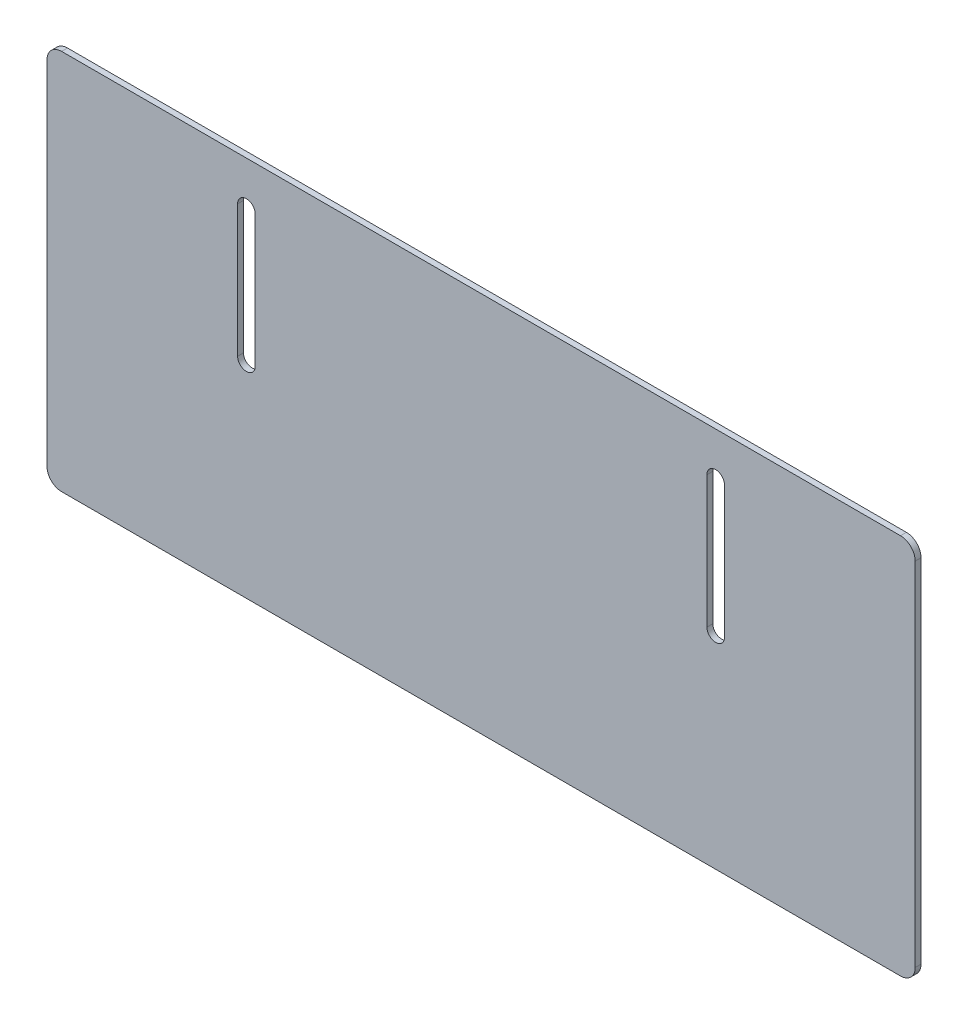
ISO-10303-21;
HEADER;
FILE_DESCRIPTION(('STEP AP214'),'2;1');
FILE_NAME('part.step','',(''),(''),'','','');
FILE_SCHEMA(('AUTOMOTIVE_DESIGN { 1 0 10303 214 1 1 1 1 }'));
ENDSEC;
DATA;
#1=APPLICATION_CONTEXT('core data for automotive mechanical design processes');
#2=APPLICATION_PROTOCOL_DEFINITION('international standard','automotive_design',2000,#1);
#3=PRODUCT_CONTEXT('',#1,'mechanical');
#4=PRODUCT('Part','Part','',(#3));
#5=PRODUCT_RELATED_PRODUCT_CATEGORY('part','',(#4));
#6=PRODUCT_DEFINITION_FORMATION('','',#4);
#7=PRODUCT_DEFINITION_CONTEXT('part definition',#1,'design');
#8=PRODUCT_DEFINITION('design','',#6,#7);
#9=PRODUCT_DEFINITION_SHAPE('','',#8);
#10=(LENGTH_UNIT() NAMED_UNIT(*) SI_UNIT(.MILLI.,.METRE.));
#11=(NAMED_UNIT(*) PLANE_ANGLE_UNIT() SI_UNIT($,.RADIAN.));
#12=(NAMED_UNIT(*) SI_UNIT($,.STERADIAN.) SOLID_ANGLE_UNIT());
#13=UNCERTAINTY_MEASURE_WITH_UNIT(LENGTH_MEASURE(1.E-05),#10,'distance_accuracy_value','');
#14=(GEOMETRIC_REPRESENTATION_CONTEXT(3) GLOBAL_UNCERTAINTY_ASSIGNED_CONTEXT((#13)) GLOBAL_UNIT_ASSIGNED_CONTEXT((#10,
#11,#12)) REPRESENTATION_CONTEXT('',''));
#15=CARTESIAN_POINT('',(0.,0.,0.));
#16=DIRECTION('',(0.,0.,1.));
#17=DIRECTION('',(1.,0.,0.));
#18=AXIS2_PLACEMENT_3D('',#15,#16,#17);
#19=CARTESIAN_POINT('',(-148.,65.,0.));
#20=DIRECTION('',(0.,-1.,0.));
#21=DIRECTION('',(-1.,0.,0.));
#22=AXIS2_PLACEMENT_3D('',#19,#20,#21);
#23=PLANE('',#22);
#24=DIRECTION('',(0.,0.,1.));
#25=VECTOR('',#24,1.);
#26=CARTESIAN_POINT('',(143.,65.,0.));
#27=LINE('',#26,#25);
#28=CARTESIAN_POINT('',(143.,65.,-2.));
#29=VERTEX_POINT('',#28);
#30=CARTESIAN_POINT('',(143.,65.,0.));
#31=VERTEX_POINT('',#30);
#32=EDGE_CURVE('E11',#29,#31,#27,.T.);
#33=ORIENTED_EDGE('',*,*,#32,.F.);
#34=DIRECTION('',(-1.,0.,0.));
#35=VECTOR('',#34,1.);
#36=CARTESIAN_POINT('',(0.,65.,-2.));
#37=LINE('',#36,#35);
#38=CARTESIAN_POINT('',(-143.,65.,-2.));
#39=VERTEX_POINT('',#38);
#40=EDGE_CURVE('E129',#29,#39,#37,.T.);
#41=ORIENTED_EDGE('',*,*,#40,.T.);
#42=DIRECTION('',(0.,0.,1.));
#43=VECTOR('',#42,1.);
#44=CARTESIAN_POINT('',(-143.,65.,0.));
#45=LINE('',#44,#43);
#46=CARTESIAN_POINT('',(-143.,65.,0.));
#47=VERTEX_POINT('',#46);
#48=EDGE_CURVE('E47',#39,#47,#45,.T.);
#49=ORIENTED_EDGE('',*,*,#48,.T.);
#50=DIRECTION('',(-1.,0.,0.));
#51=VECTOR('',#50,1.);
#52=CARTESIAN_POINT('',(-148.,65.,0.));
#53=LINE('',#52,#51);
#54=EDGE_CURVE('E197',#31,#47,#53,.T.);
#55=ORIENTED_EDGE('',*,*,#54,.F.);
#56=EDGE_LOOP('',(#33,#41,#49,#55));
#57=FACE_BOUND('',#56,.T.);
#58=ADVANCED_FACE('F37',(#57),#23,.F.);
#59=CARTESIAN_POINT('',(-143.,60.,0.));
#60=DIRECTION('',(0.,0.,-1.));
#61=DIRECTION('',(-1.,0.,0.));
#62=AXIS2_PLACEMENT_3D('',#59,#60,#61);
#63=CYLINDRICAL_SURFACE('',#62,5.);
#64=ORIENTED_EDGE('',*,*,#48,.F.);
#65=CARTESIAN_POINT('',(-143.,60.,-2.));
#66=DIRECTION('',(0.,0.,-1.));
#67=DIRECTION('',(-1.,0.,0.));
#68=AXIS2_PLACEMENT_3D('',#65,#66,#67);
#69=CIRCLE('',#68,5.);
#70=CARTESIAN_POINT('',(-148.,60.,-2.));
#71=VERTEX_POINT('',#70);
#72=EDGE_CURVE('E153',#39,#71,#69,.F.);
#73=ORIENTED_EDGE('',*,*,#72,.T.);
#74=DIRECTION('',(0.,0.,1.));
#75=VECTOR('',#74,1.);
#76=CARTESIAN_POINT('',(-148.,60.,0.));
#77=LINE('',#76,#75);
#78=CARTESIAN_POINT('',(-148.,60.,0.));
#79=VERTEX_POINT('',#78);
#80=EDGE_CURVE('E190',#71,#79,#77,.T.);
#81=ORIENTED_EDGE('',*,*,#80,.T.);
#82=CARTESIAN_POINT('',(-143.,60.,0.));
#83=DIRECTION('',(0.,0.,-1.));
#84=DIRECTION('',(-1.,0.,0.));
#85=AXIS2_PLACEMENT_3D('',#82,#83,#84);
#86=CIRCLE('',#85,5.);
#87=EDGE_CURVE('E206',#47,#79,#86,.F.);
#88=ORIENTED_EDGE('',*,*,#87,.F.);
#89=EDGE_LOOP('',(#64,#73,#81,#88));
#90=FACE_BOUND('',#89,.T.);
#91=ADVANCED_FACE('F209',(#90),#63,.T.);
#92=CARTESIAN_POINT('',(-148.,-65.,0.));
#93=DIRECTION('',(1.,0.,0.));
#94=DIRECTION('',(0.,-1.,0.));
#95=AXIS2_PLACEMENT_3D('',#92,#93,#94);
#96=PLANE('',#95);
#97=ORIENTED_EDGE('',*,*,#80,.F.);
#98=DIRECTION('',(0.,1.,0.));
#99=VECTOR('',#98,1.);
#100=CARTESIAN_POINT('',(-148.,0.,-2.));
#101=LINE('',#100,#99);
#102=CARTESIAN_POINT('',(-148.,-60.,-2.));
#103=VERTEX_POINT('',#102);
#104=EDGE_CURVE('E150',#71,#103,#101,.F.);
#105=ORIENTED_EDGE('',*,*,#104,.T.);
#106=DIRECTION('',(0.,0.,1.));
#107=VECTOR('',#106,1.);
#108=CARTESIAN_POINT('',(-148.,-60.,0.));
#109=LINE('',#108,#107);
#110=CARTESIAN_POINT('',(-148.,-60.,0.));
#111=VERTEX_POINT('',#110);
#112=EDGE_CURVE('E187',#103,#111,#109,.T.);
#113=ORIENTED_EDGE('',*,*,#112,.T.);
#114=DIRECTION('',(0.,-1.,0.));
#115=VECTOR('',#114,1.);
#116=CARTESIAN_POINT('',(-148.,-65.,0.));
#117=LINE('',#116,#115);
#118=EDGE_CURVE('E210',#79,#111,#117,.T.);
#119=ORIENTED_EDGE('',*,*,#118,.F.);
#120=EDGE_LOOP('',(#97,#105,#113,#119));
#121=FACE_BOUND('',#120,.T.);
#122=ADVANCED_FACE('F337',(#121),#96,.F.);
#123=CARTESIAN_POINT('',(-143.,-60.,0.));
#124=DIRECTION('',(0.,0.,-1.));
#125=DIRECTION('',(-1.,0.,0.));
#126=AXIS2_PLACEMENT_3D('',#123,#124,#125);
#127=CYLINDRICAL_SURFACE('',#126,5.);
#128=ORIENTED_EDGE('',*,*,#112,.F.);
#129=CARTESIAN_POINT('',(-143.,-60.,-2.));
#130=DIRECTION('',(0.,0.,-1.));
#131=DIRECTION('',(-1.,0.,0.));
#132=AXIS2_PLACEMENT_3D('',#129,#130,#131);
#133=CIRCLE('',#132,5.);
#134=CARTESIAN_POINT('',(-143.,-65.,-2.));
#135=VERTEX_POINT('',#134);
#136=EDGE_CURVE('E147',#103,#135,#133,.F.);
#137=ORIENTED_EDGE('',*,*,#136,.T.);
#138=DIRECTION('',(0.,0.,1.));
#139=VECTOR('',#138,1.);
#140=CARTESIAN_POINT('',(-143.,-65.,0.));
#141=LINE('',#140,#139);
#142=CARTESIAN_POINT('',(-143.,-65.,0.));
#143=VERTEX_POINT('',#142);
#144=EDGE_CURVE('E184',#135,#143,#141,.T.);
#145=ORIENTED_EDGE('',*,*,#144,.T.);
#146=CARTESIAN_POINT('',(-143.,-60.,0.));
#147=DIRECTION('',(0.,0.,-1.));
#148=DIRECTION('',(-1.,0.,0.));
#149=AXIS2_PLACEMENT_3D('',#146,#147,#148);
#150=CIRCLE('',#149,5.);
#151=EDGE_CURVE('E212',#111,#143,#150,.F.);
#152=ORIENTED_EDGE('',*,*,#151,.F.);
#153=EDGE_LOOP('',(#128,#137,#145,#152));
#154=FACE_BOUND('',#153,.T.);
#155=ADVANCED_FACE('F269',(#154),#127,.T.);
#156=CARTESIAN_POINT('',(-148.,-65.,0.));
#157=DIRECTION('',(0.,1.,0.));
#158=DIRECTION('',(1.,0.,0.));
#159=AXIS2_PLACEMENT_3D('',#156,#157,#158);
#160=PLANE('',#159);
#161=ORIENTED_EDGE('',*,*,#144,.F.);
#162=DIRECTION('',(-1.,0.,0.));
#163=VECTOR('',#162,1.);
#164=CARTESIAN_POINT('',(0.,-65.,-2.));
#165=LINE('',#164,#163);
#166=CARTESIAN_POINT('',(143.,-65.,-2.));
#167=VERTEX_POINT('',#166);
#168=EDGE_CURVE('E144',#135,#167,#165,.F.);
#169=ORIENTED_EDGE('',*,*,#168,.T.);
#170=DIRECTION('',(0.,0.,1.));
#171=VECTOR('',#170,1.);
#172=CARTESIAN_POINT('',(143.,-65.,0.));
#173=LINE('',#172,#171);
#174=CARTESIAN_POINT('',(143.,-65.,0.));
#175=VERTEX_POINT('',#174);
#176=EDGE_CURVE('E182',#167,#175,#173,.T.);
#177=ORIENTED_EDGE('',*,*,#176,.T.);
#178=DIRECTION('',(1.,0.,0.));
#179=VECTOR('',#178,1.);
#180=CARTESIAN_POINT('',(-148.,-65.,0.));
#181=LINE('',#180,#179);
#182=EDGE_CURVE('E218',#143,#175,#181,.T.);
#183=ORIENTED_EDGE('',*,*,#182,.F.);
#184=EDGE_LOOP('',(#161,#169,#177,#183));
#185=FACE_BOUND('',#184,.T.);
#186=ADVANCED_FACE('F274',(#185),#160,.F.);
#187=CARTESIAN_POINT('',(143.,-60.,0.));
#188=DIRECTION('',(0.,0.,-1.));
#189=DIRECTION('',(-1.,0.,0.));
#190=AXIS2_PLACEMENT_3D('',#187,#188,#189);
#191=CYLINDRICAL_SURFACE('',#190,5.);
#192=ORIENTED_EDGE('',*,*,#176,.F.);
#193=CARTESIAN_POINT('',(143.,-60.,-2.));
#194=DIRECTION('',(0.,0.,-1.));
#195=DIRECTION('',(-1.,0.,0.));
#196=AXIS2_PLACEMENT_3D('',#193,#194,#195);
#197=CIRCLE('',#196,5.);
#198=CARTESIAN_POINT('',(148.,-60.,-2.));
#199=VERTEX_POINT('',#198);
#200=EDGE_CURVE('E141',#167,#199,#197,.F.);
#201=ORIENTED_EDGE('',*,*,#200,.T.);
#202=DIRECTION('',(0.,0.,1.));
#203=VECTOR('',#202,1.);
#204=CARTESIAN_POINT('',(148.,-60.,0.));
#205=LINE('',#204,#203);
#206=CARTESIAN_POINT('',(148.,-60.,0.));
#207=VERTEX_POINT('',#206);
#208=EDGE_CURVE('E55',#199,#207,#205,.T.);
#209=ORIENTED_EDGE('',*,*,#208,.T.);
#210=CARTESIAN_POINT('',(143.,-60.,0.));
#211=DIRECTION('',(0.,0.,-1.));
#212=DIRECTION('',(-1.,0.,0.));
#213=AXIS2_PLACEMENT_3D('',#210,#211,#212);
#214=CIRCLE('',#213,5.);
#215=EDGE_CURVE('E170',#175,#207,#214,.F.);
#216=ORIENTED_EDGE('',*,*,#215,.F.);
#217=EDGE_LOOP('',(#192,#201,#209,#216));
#218=FACE_BOUND('',#217,.T.);
#219=ADVANCED_FACE('F275',(#218),#191,.T.);
#220=CARTESIAN_POINT('',(148.,-65.,0.));
#221=DIRECTION('',(-1.,0.,0.));
#222=DIRECTION('',(0.,1.,0.));
#223=AXIS2_PLACEMENT_3D('',#220,#221,#222);
#224=PLANE('',#223);
#225=ORIENTED_EDGE('',*,*,#208,.F.);
#226=DIRECTION('',(0.,1.,0.));
#227=VECTOR('',#226,1.);
#228=CARTESIAN_POINT('',(148.,0.,-2.));
#229=LINE('',#228,#227);
#230=CARTESIAN_POINT('',(148.,60.,-2.));
#231=VERTEX_POINT('',#230);
#232=EDGE_CURVE('E127',#199,#231,#229,.T.);
#233=ORIENTED_EDGE('',*,*,#232,.T.);
#234=DIRECTION('',(0.,0.,1.));
#235=VECTOR('',#234,1.);
#236=CARTESIAN_POINT('',(148.,60.,0.));
#237=LINE('',#236,#235);
#238=CARTESIAN_POINT('',(148.,60.,0.));
#239=VERTEX_POINT('',#238);
#240=EDGE_CURVE('E41',#231,#239,#237,.T.);
#241=ORIENTED_EDGE('',*,*,#240,.T.);
#242=DIRECTION('',(0.,1.,0.));
#243=VECTOR('',#242,1.);
#244=CARTESIAN_POINT('',(148.,-65.,0.));
#245=LINE('',#244,#243);
#246=EDGE_CURVE('E276',#207,#239,#245,.T.);
#247=ORIENTED_EDGE('',*,*,#246,.F.);
#248=EDGE_LOOP('',(#225,#233,#241,#247));
#249=FACE_BOUND('',#248,.T.);
#250=ADVANCED_FACE('F131',(#249),#224,.F.);
#251=CARTESIAN_POINT('',(77.,50.,0.));
#252=DIRECTION('',(1.,0.,0.));
#253=DIRECTION('',(0.,-1.,0.));
#254=AXIS2_PLACEMENT_3D('',#251,#252,#253);
#255=PLANE('',#254);
#256=DIRECTION('',(0.,0.,1.));
#257=VECTOR('',#256,1.);
#258=CARTESIAN_POINT('',(77.,5.00000000000002,0.));
#259=LINE('',#258,#257);
#260=CARTESIAN_POINT('',(77.,5.00000000000002,-2.));
#261=VERTEX_POINT('',#260);
#262=CARTESIAN_POINT('',(77.,5.00000000000002,0.));
#263=VERTEX_POINT('',#262);
#264=EDGE_CURVE('E122',#261,#263,#259,.T.);
#265=ORIENTED_EDGE('',*,*,#264,.F.);
#266=DIRECTION('',(0.,1.,0.));
#267=VECTOR('',#266,1.);
#268=CARTESIAN_POINT('',(77.,0.,-2.));
#269=LINE('',#268,#267);
#270=CARTESIAN_POINT('',(77.,50.,-2.));
#271=VERTEX_POINT('',#270);
#272=EDGE_CURVE('E135',#271,#261,#269,.F.);
#273=ORIENTED_EDGE('',*,*,#272,.F.);
#274=DIRECTION('',(0.,0.,1.));
#275=VECTOR('',#274,1.);
#276=CARTESIAN_POINT('',(77.,50.,0.));
#277=LINE('',#276,#275);
#278=CARTESIAN_POINT('',(77.,50.,0.));
#279=VERTEX_POINT('',#278);
#280=EDGE_CURVE('E174',#271,#279,#277,.T.);
#281=ORIENTED_EDGE('',*,*,#280,.T.);
#282=DIRECTION('',(0.,-1.,0.));
#283=VECTOR('',#282,1.);
#284=CARTESIAN_POINT('',(77.,50.,0.));
#285=LINE('',#284,#283);
#286=EDGE_CURVE('E278',#279,#263,#285,.T.);
#287=ORIENTED_EDGE('',*,*,#286,.T.);
#288=EDGE_LOOP('',(#265,#273,#281,#287));
#289=FACE_BOUND('',#288,.T.);
#290=ADVANCED_FACE('F323',(#289),#255,.T.);
#291=CARTESIAN_POINT('',(80.,50.,0.));
#292=DIRECTION('',(0.,0.,-1.));
#293=DIRECTION('',(-1.,0.,0.));
#294=AXIS2_PLACEMENT_3D('',#291,#292,#293);
#295=CYLINDRICAL_SURFACE('',#294,2.99999999999999);
#296=ORIENTED_EDGE('',*,*,#280,.F.);
#297=CARTESIAN_POINT('',(80.,50.,-2.));
#298=DIRECTION('',(0.,0.,1.));
#299=DIRECTION('',(1.,0.,0.));
#300=AXIS2_PLACEMENT_3D('',#297,#298,#299);
#301=CIRCLE('',#300,2.99999999999999);
#302=CARTESIAN_POINT('',(83.,50.,-2.));
#303=VERTEX_POINT('',#302);
#304=EDGE_CURVE('E132',#303,#271,#301,.T.);
#305=ORIENTED_EDGE('',*,*,#304,.F.);
#306=DIRECTION('',(0.,0.,1.));
#307=VECTOR('',#306,1.);
#308=CARTESIAN_POINT('',(83.,50.,0.));
#309=LINE('',#308,#307);
#310=CARTESIAN_POINT('',(83.,50.,0.));
#311=VERTEX_POINT('',#310);
#312=EDGE_CURVE('E171',#303,#311,#309,.T.);
#313=ORIENTED_EDGE('',*,*,#312,.T.);
#314=CARTESIAN_POINT('',(80.,50.,0.));
#315=DIRECTION('',(0.,0.,1.));
#316=DIRECTION('',(-1.,0.,0.));
#317=AXIS2_PLACEMENT_3D('',#314,#315,#316);
#318=CIRCLE('',#317,2.99999999999999);
#319=EDGE_CURVE('E257',#311,#279,#318,.T.);
#320=ORIENTED_EDGE('',*,*,#319,.T.);
#321=EDGE_LOOP('',(#296,#305,#313,#320));
#322=FACE_BOUND('',#321,.T.);
#323=ADVANCED_FACE('F255',(#322),#295,.F.);
#324=CARTESIAN_POINT('',(83.,50.,0.));
#325=DIRECTION('',(-1.,0.,0.));
#326=DIRECTION('',(0.,1.,0.));
#327=AXIS2_PLACEMENT_3D('',#324,#325,#326);
#328=PLANE('',#327);
#329=ORIENTED_EDGE('',*,*,#312,.F.);
#330=DIRECTION('',(0.,1.,0.));
#331=VECTOR('',#330,1.);
#332=CARTESIAN_POINT('',(83.,0.,-2.));
#333=LINE('',#332,#331);
#334=CARTESIAN_POINT('',(83.,5.00000000000002,-2.));
#335=VERTEX_POINT('',#334);
#336=EDGE_CURVE('E230',#335,#303,#333,.T.);
#337=ORIENTED_EDGE('',*,*,#336,.F.);
#338=DIRECTION('',(0.,0.,1.));
#339=VECTOR('',#338,1.);
#340=CARTESIAN_POINT('',(83.,5.00000000000002,0.));
#341=LINE('',#340,#339);
#342=CARTESIAN_POINT('',(83.,5.00000000000002,0.));
#343=VERTEX_POINT('',#342);
#344=EDGE_CURVE('E167',#335,#343,#341,.T.);
#345=ORIENTED_EDGE('',*,*,#344,.T.);
#346=DIRECTION('',(0.,1.,0.));
#347=VECTOR('',#346,1.);
#348=CARTESIAN_POINT('',(83.,50.,0.));
#349=LINE('',#348,#347);
#350=EDGE_CURVE('E251',#343,#311,#349,.T.);
#351=ORIENTED_EDGE('',*,*,#350,.T.);
#352=EDGE_LOOP('',(#329,#337,#345,#351));
#353=FACE_BOUND('',#352,.T.);
#354=ADVANCED_FACE('F246',(#353),#328,.T.);
#355=CARTESIAN_POINT('',(-77.,50.,0.));
#356=DIRECTION('',(-1.,0.,0.));
#357=DIRECTION('',(0.,1.,0.));
#358=AXIS2_PLACEMENT_3D('',#355,#356,#357);
#359=PLANE('',#358);
#360=DIRECTION('',(0.,0.,1.));
#361=VECTOR('',#360,1.);
#362=CARTESIAN_POINT('',(-77.,50.,0.));
#363=LINE('',#362,#361);
#364=CARTESIAN_POINT('',(-77.,50.,-2.));
#365=VERTEX_POINT('',#364);
#366=CARTESIAN_POINT('',(-77.,50.,0.));
#367=VERTEX_POINT('',#366);
#368=EDGE_CURVE('E164',#365,#367,#363,.T.);
#369=ORIENTED_EDGE('',*,*,#368,.F.);
#370=DIRECTION('',(0.,1.,0.));
#371=VECTOR('',#370,1.);
#372=CARTESIAN_POINT('',(-77.,0.,-2.));
#373=LINE('',#372,#371);
#374=CARTESIAN_POINT('',(-77.,5.00000000000001,-2.));
#375=VERTEX_POINT('',#374);
#376=EDGE_CURVE('E231',#375,#365,#373,.T.);
#377=ORIENTED_EDGE('',*,*,#376,.F.);
#378=DIRECTION('',(0.,0.,1.));
#379=VECTOR('',#378,1.);
#380=CARTESIAN_POINT('',(-77.,5.00000000000001,0.));
#381=LINE('',#380,#379);
#382=CARTESIAN_POINT('',(-77.,5.00000000000001,0.));
#383=VERTEX_POINT('',#382);
#384=EDGE_CURVE('E160',#375,#383,#381,.T.);
#385=ORIENTED_EDGE('',*,*,#384,.T.);
#386=DIRECTION('',(0.,1.,0.));
#387=VECTOR('',#386,1.);
#388=CARTESIAN_POINT('',(-77.,50.,0.));
#389=LINE('',#388,#387);
#390=EDGE_CURVE('E290',#383,#367,#389,.T.);
#391=ORIENTED_EDGE('',*,*,#390,.T.);
#392=EDGE_LOOP('',(#369,#377,#385,#391));
#393=FACE_BOUND('',#392,.T.);
#394=ADVANCED_FACE('F363',(#393),#359,.T.);
#395=CARTESIAN_POINT('',(-80.,5.00000000000001,0.));
#396=DIRECTION('',(0.,0.,-1.));
#397=DIRECTION('',(-1.,0.,0.));
#398=AXIS2_PLACEMENT_3D('',#395,#396,#397);
#399=CYLINDRICAL_SURFACE('',#398,3.00000000000002);
#400=ORIENTED_EDGE('',*,*,#384,.F.);
#401=CARTESIAN_POINT('',(-80.,5.00000000000001,-2.));
#402=DIRECTION('',(0.,0.,1.));
#403=DIRECTION('',(1.,0.,0.));
#404=AXIS2_PLACEMENT_3D('',#401,#402,#403);
#405=CIRCLE('',#404,3.00000000000002);
#406=CARTESIAN_POINT('',(-83.,5.00000000000001,-2.));
#407=VERTEX_POINT('',#406);
#408=EDGE_CURVE('E227',#407,#375,#405,.T.);
#409=ORIENTED_EDGE('',*,*,#408,.F.);
#410=DIRECTION('',(0.,0.,1.));
#411=VECTOR('',#410,1.);
#412=CARTESIAN_POINT('',(-83.,5.00000000000001,0.));
#413=LINE('',#412,#411);
#414=CARTESIAN_POINT('',(-83.,5.00000000000001,0.));
#415=VERTEX_POINT('',#414);
#416=EDGE_CURVE('E157',#407,#415,#413,.T.);
#417=ORIENTED_EDGE('',*,*,#416,.T.);
#418=CARTESIAN_POINT('',(-80.,5.00000000000001,0.));
#419=DIRECTION('',(0.,0.,1.));
#420=DIRECTION('',(1.,0.,0.));
#421=AXIS2_PLACEMENT_3D('',#418,#419,#420);
#422=CIRCLE('',#421,3.00000000000002);
#423=EDGE_CURVE('E287',#415,#383,#422,.T.);
#424=ORIENTED_EDGE('',*,*,#423,.T.);
#425=EDGE_LOOP('',(#400,#409,#417,#424));
#426=FACE_BOUND('',#425,.T.);
#427=ADVANCED_FACE('F310',(#426),#399,.F.);
#428=CARTESIAN_POINT('',(-83.,50.,0.));
#429=DIRECTION('',(1.,0.,0.));
#430=DIRECTION('',(0.,-1.,0.));
#431=AXIS2_PLACEMENT_3D('',#428,#429,#430);
#432=PLANE('',#431);
#433=ORIENTED_EDGE('',*,*,#416,.F.);
#434=DIRECTION('',(0.,1.,0.));
#435=VECTOR('',#434,1.);
#436=CARTESIAN_POINT('',(-83.,0.,-2.));
#437=LINE('',#436,#435);
#438=CARTESIAN_POINT('',(-83.,50.,-2.));
#439=VERTEX_POINT('',#438);
#440=EDGE_CURVE('E223',#439,#407,#437,.F.);
#441=ORIENTED_EDGE('',*,*,#440,.F.);
#442=DIRECTION('',(0.,0.,1.));
#443=VECTOR('',#442,1.);
#444=CARTESIAN_POINT('',(-83.,50.,0.));
#445=LINE('',#444,#443);
#446=CARTESIAN_POINT('',(-83.,50.,0.));
#447=VERTEX_POINT('',#446);
#448=EDGE_CURVE('E161',#439,#447,#445,.T.);
#449=ORIENTED_EDGE('',*,*,#448,.T.);
#450=DIRECTION('',(0.,-1.,0.));
#451=VECTOR('',#450,1.);
#452=CARTESIAN_POINT('',(-83.,50.,0.));
#453=LINE('',#452,#451);
#454=EDGE_CURVE('E143',#447,#415,#453,.T.);
#455=ORIENTED_EDGE('',*,*,#454,.T.);
#456=EDGE_LOOP('',(#433,#441,#449,#455));
#457=FACE_BOUND('',#456,.T.);
#458=ADVANCED_FACE('F301',(#457),#432,.T.);
#459=CARTESIAN_POINT('',(-80.,50.,0.));
#460=DIRECTION('',(0.,0.,-1.));
#461=DIRECTION('',(-1.,0.,0.));
#462=AXIS2_PLACEMENT_3D('',#459,#460,#461);
#463=CYLINDRICAL_SURFACE('',#462,2.99999999999999);
#464=CARTESIAN_POINT('',(-80.,50.,-2.));
#465=DIRECTION('',(0.,0.,1.));
#466=DIRECTION('',(1.,0.,0.));
#467=AXIS2_PLACEMENT_3D('',#464,#465,#466);
#468=CIRCLE('',#467,2.99999999999999);
#469=EDGE_CURVE('E226',#365,#439,#468,.T.);
#470=ORIENTED_EDGE('',*,*,#469,.F.);
#471=ORIENTED_EDGE('',*,*,#368,.T.);
#472=CARTESIAN_POINT('',(-80.,50.,0.));
#473=DIRECTION('',(0.,0.,1.));
#474=DIRECTION('',(1.,0.,0.));
#475=AXIS2_PLACEMENT_3D('',#472,#473,#474);
#476=CIRCLE('',#475,2.99999999999999);
#477=EDGE_CURVE('E293',#367,#447,#476,.T.);
#478=ORIENTED_EDGE('',*,*,#477,.T.);
#479=ORIENTED_EDGE('',*,*,#448,.F.);
#480=EDGE_LOOP('',(#470,#471,#478,#479));
#481=FACE_BOUND('',#480,.T.);
#482=ADVANCED_FACE('F349',(#481),#463,.F.);
#483=CARTESIAN_POINT('',(80.,5.00000000000002,0.));
#484=DIRECTION('',(0.,0.,-1.));
#485=DIRECTION('',(-1.,0.,0.));
#486=AXIS2_PLACEMENT_3D('',#483,#484,#485);
#487=CYLINDRICAL_SURFACE('',#486,3.00000000000002);
#488=CARTESIAN_POINT('',(80.,5.00000000000002,-2.));
#489=DIRECTION('',(0.,0.,1.));
#490=DIRECTION('',(1.,0.,0.));
#491=AXIS2_PLACEMENT_3D('',#488,#489,#490);
#492=CIRCLE('',#491,3.00000000000002);
#493=EDGE_CURVE('E139',#261,#335,#492,.T.);
#494=ORIENTED_EDGE('',*,*,#493,.F.);
#495=ORIENTED_EDGE('',*,*,#264,.T.);
#496=CARTESIAN_POINT('',(80.,5.00000000000002,0.));
#497=DIRECTION('',(0.,0.,1.));
#498=DIRECTION('',(-1.,0.,0.));
#499=AXIS2_PLACEMENT_3D('',#496,#497,#498);
#500=CIRCLE('',#499,3.00000000000002);
#501=EDGE_CURVE('E283',#263,#343,#500,.T.);
#502=ORIENTED_EDGE('',*,*,#501,.T.);
#503=ORIENTED_EDGE('',*,*,#344,.F.);
#504=EDGE_LOOP('',(#494,#495,#502,#503));
#505=FACE_BOUND('',#504,.T.);
#506=ADVANCED_FACE('F320',(#505),#487,.F.);
#507=CARTESIAN_POINT('',(143.,60.,0.));
#508=DIRECTION('',(0.,0.,-1.));
#509=DIRECTION('',(-1.,0.,0.));
#510=AXIS2_PLACEMENT_3D('',#507,#508,#509);
#511=CYLINDRICAL_SURFACE('',#510,5.);
#512=CARTESIAN_POINT('',(143.,60.,-2.));
#513=DIRECTION('',(0.,0.,-1.));
#514=DIRECTION('',(-1.,0.,0.));
#515=AXIS2_PLACEMENT_3D('',#512,#513,#514);
#516=CIRCLE('',#515,5.);
#517=EDGE_CURVE('E115',#231,#29,#516,.F.);
#518=ORIENTED_EDGE('',*,*,#517,.T.);
#519=ORIENTED_EDGE('',*,*,#32,.T.);
#520=CARTESIAN_POINT('',(143.,60.,0.));
#521=DIRECTION('',(0.,0.,-1.));
#522=DIRECTION('',(-1.,0.,0.));
#523=AXIS2_PLACEMENT_3D('',#520,#521,#522);
#524=CIRCLE('',#523,5.);
#525=EDGE_CURVE('E118',#239,#31,#524,.F.);
#526=ORIENTED_EDGE('',*,*,#525,.F.);
#527=ORIENTED_EDGE('',*,*,#240,.F.);
#528=EDGE_LOOP('',(#518,#519,#526,#527));
#529=FACE_BOUND('',#528,.T.);
#530=ADVANCED_FACE('F39',(#529),#511,.T.);
#531=CARTESIAN_POINT('',(0.,0.,0.));
#532=DIRECTION('',(0.,0.,-1.));
#533=DIRECTION('',(-1.,0.,0.));
#534=AXIS2_PLACEMENT_3D('',#531,#532,#533);
#535=PLANE('',#534);
#536=ORIENTED_EDGE('',*,*,#454,.F.);
#537=ORIENTED_EDGE('',*,*,#477,.F.);
#538=ORIENTED_EDGE('',*,*,#390,.F.);
#539=ORIENTED_EDGE('',*,*,#423,.F.);
#540=EDGE_LOOP('',(#536,#537,#538,#539));
#541=FACE_BOUND('',#540,.T.);
#542=ORIENTED_EDGE('',*,*,#350,.F.);
#543=ORIENTED_EDGE('',*,*,#501,.F.);
#544=ORIENTED_EDGE('',*,*,#286,.F.);
#545=ORIENTED_EDGE('',*,*,#319,.F.);
#546=EDGE_LOOP('',(#542,#543,#544,#545));
#547=FACE_BOUND('',#546,.T.);
#548=ORIENTED_EDGE('',*,*,#246,.T.);
#549=ORIENTED_EDGE('',*,*,#525,.T.);
#550=ORIENTED_EDGE('',*,*,#54,.T.);
#551=ORIENTED_EDGE('',*,*,#87,.T.);
#552=ORIENTED_EDGE('',*,*,#118,.T.);
#553=ORIENTED_EDGE('',*,*,#151,.T.);
#554=ORIENTED_EDGE('',*,*,#182,.T.);
#555=ORIENTED_EDGE('',*,*,#215,.T.);
#556=EDGE_LOOP('',(#548,#549,#550,#551,#552,#553,#554,#555));
#557=FACE_BOUND('',#556,.T.);
#558=ADVANCED_FACE('F204',(#541,#547,#557),#535,.F.);
#559=CARTESIAN_POINT('',(0.,0.,-2.));
#560=DIRECTION('',(0.,0.,-1.));
#561=DIRECTION('',(-1.,0.,0.));
#562=AXIS2_PLACEMENT_3D('',#559,#560,#561);
#563=PLANE('',#562);
#564=ORIENTED_EDGE('',*,*,#440,.T.);
#565=ORIENTED_EDGE('',*,*,#408,.T.);
#566=ORIENTED_EDGE('',*,*,#376,.T.);
#567=ORIENTED_EDGE('',*,*,#469,.T.);
#568=EDGE_LOOP('',(#564,#565,#566,#567));
#569=FACE_BOUND('',#568,.T.);
#570=ORIENTED_EDGE('',*,*,#336,.T.);
#571=ORIENTED_EDGE('',*,*,#304,.T.);
#572=ORIENTED_EDGE('',*,*,#272,.T.);
#573=ORIENTED_EDGE('',*,*,#493,.T.);
#574=EDGE_LOOP('',(#570,#571,#572,#573));
#575=FACE_BOUND('',#574,.T.);
#576=ORIENTED_EDGE('',*,*,#232,.F.);
#577=ORIENTED_EDGE('',*,*,#200,.F.);
#578=ORIENTED_EDGE('',*,*,#168,.F.);
#579=ORIENTED_EDGE('',*,*,#136,.F.);
#580=ORIENTED_EDGE('',*,*,#104,.F.);
#581=ORIENTED_EDGE('',*,*,#72,.F.);
#582=ORIENTED_EDGE('',*,*,#40,.F.);
#583=ORIENTED_EDGE('',*,*,#517,.F.);
#584=EDGE_LOOP('',(#576,#577,#578,#579,#580,#581,#582,#583));
#585=FACE_BOUND('',#584,.T.);
#586=ADVANCED_FACE('F125',(#569,#575,#585),#563,.T.);
#587=CLOSED_SHELL('',(#58,#91,#122,#155,#186,#219,#250,#290,#323,#354,#394,#427,#458,#482,#506,
#530,#558,#586));
#588=MANIFOLD_SOLID_BREP('B2',#587);
#589=ADVANCED_BREP_SHAPE_REPRESENTATION('',(#18,#588),#14);
#590=SHAPE_DEFINITION_REPRESENTATION(#9,#589);
ENDSEC;
END-ISO-10303-21;
